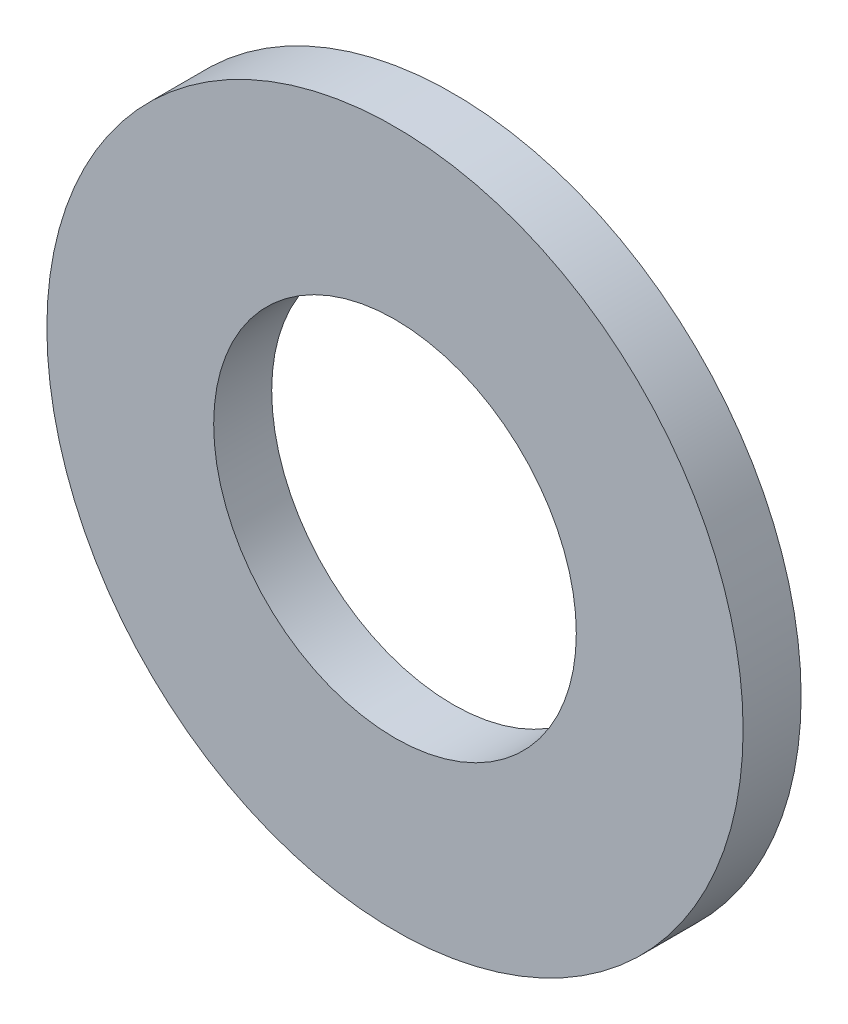
ISO-10303-21;
HEADER;
FILE_DESCRIPTION(('STEP AP214'),'2;1');
FILE_NAME('part.step','',(''),(''),'','','');
FILE_SCHEMA(('AUTOMOTIVE_DESIGN { 1 0 10303 214 1 1 1 1 }'));
ENDSEC;
DATA;
#1=APPLICATION_CONTEXT('core data for automotive mechanical design processes');
#2=APPLICATION_PROTOCOL_DEFINITION('international standard','automotive_design',2000,#1);
#3=PRODUCT_CONTEXT('',#1,'mechanical');
#4=PRODUCT('Part','Part','',(#3));
#5=PRODUCT_RELATED_PRODUCT_CATEGORY('part','',(#4));
#6=PRODUCT_DEFINITION_FORMATION('','',#4);
#7=PRODUCT_DEFINITION_CONTEXT('part definition',#1,'design');
#8=PRODUCT_DEFINITION('design','',#6,#7);
#9=PRODUCT_DEFINITION_SHAPE('','',#8);
#10=(LENGTH_UNIT() NAMED_UNIT(*) SI_UNIT(.MILLI.,.METRE.));
#11=(NAMED_UNIT(*) PLANE_ANGLE_UNIT() SI_UNIT($,.RADIAN.));
#12=(NAMED_UNIT(*) SI_UNIT($,.STERADIAN.) SOLID_ANGLE_UNIT());
#13=UNCERTAINTY_MEASURE_WITH_UNIT(LENGTH_MEASURE(1.E-05),#10,'distance_accuracy_value','');
#14=(GEOMETRIC_REPRESENTATION_CONTEXT(3) GLOBAL_UNCERTAINTY_ASSIGNED_CONTEXT((#13)) GLOBAL_UNIT_ASSIGNED_CONTEXT((#10,
#11,#12)) REPRESENTATION_CONTEXT('',''));
#15=CARTESIAN_POINT('',(0.,0.,0.));
#16=DIRECTION('',(0.,0.,1.));
#17=DIRECTION('',(1.,0.,0.));
#18=AXIS2_PLACEMENT_3D('',#15,#16,#17);
#19=CARTESIAN_POINT('',(0.,0.,1.));
#20=DIRECTION('',(0.,0.,1.));
#21=DIRECTION('',(1.,0.,0.));
#22=AXIS2_PLACEMENT_3D('',#19,#20,#21);
#23=PLANE('',#22);
#24=CARTESIAN_POINT('',(0.,0.,1.));
#25=DIRECTION('',(0.,0.,1.));
#26=DIRECTION('',(1.,0.,0.));
#27=AXIS2_PLACEMENT_3D('',#24,#25,#26);
#28=CIRCLE('',#27,6.);
#29=CARTESIAN_POINT('',(6.,0.,1.));
#30=VERTEX_POINT('',#29);
#31=EDGE_CURVE('E10',#30,#30,#28,.T.);
#32=ORIENTED_EDGE('',*,*,#31,.T.);
#33=EDGE_LOOP('',(#32));
#34=FACE_BOUND('',#33,.T.);
#35=CARTESIAN_POINT('',(0.,0.,1.));
#36=DIRECTION('',(0.,0.,1.));
#37=DIRECTION('',(1.,0.,0.));
#38=AXIS2_PLACEMENT_3D('',#35,#36,#37);
#39=CIRCLE('',#38,3.125);
#40=CARTESIAN_POINT('',(3.125,0.,1.));
#41=VERTEX_POINT('',#40);
#42=EDGE_CURVE('E54',#41,#41,#39,.T.);
#43=ORIENTED_EDGE('',*,*,#42,.F.);
#44=EDGE_LOOP('',(#43));
#45=FACE_BOUND('',#44,.T.);
#46=ADVANCED_FACE('F41',(#34,#45),#23,.T.);
#47=CARTESIAN_POINT('',(0.,0.,0.));
#48=DIRECTION('',(0.,0.,1.));
#49=DIRECTION('',(1.,0.,0.));
#50=AXIS2_PLACEMENT_3D('',#47,#48,#49);
#51=PLANE('',#50);
#52=CARTESIAN_POINT('',(0.,0.,0.));
#53=DIRECTION('',(0.,0.,1.));
#54=DIRECTION('',(1.,0.,0.));
#55=AXIS2_PLACEMENT_3D('',#52,#53,#54);
#56=CIRCLE('',#55,6.);
#57=CARTESIAN_POINT('',(6.,0.,0.));
#58=VERTEX_POINT('',#57);
#59=EDGE_CURVE('E45',#58,#58,#56,.T.);
#60=ORIENTED_EDGE('',*,*,#59,.F.);
#61=EDGE_LOOP('',(#60));
#62=FACE_BOUND('',#61,.T.);
#63=CARTESIAN_POINT('',(0.,0.,0.));
#64=DIRECTION('',(0.,0.,1.));
#65=DIRECTION('',(1.,0.,0.));
#66=AXIS2_PLACEMENT_3D('',#63,#64,#65);
#67=CIRCLE('',#66,3.125);
#68=CARTESIAN_POINT('',(3.125,0.,0.));
#69=VERTEX_POINT('',#68);
#70=EDGE_CURVE('E56',#69,#69,#67,.T.);
#71=ORIENTED_EDGE('',*,*,#70,.T.);
#72=EDGE_LOOP('',(#71));
#73=FACE_BOUND('',#72,.T.);
#74=ADVANCED_FACE('F68',(#62,#73),#51,.F.);
#75=CARTESIAN_POINT('',(0.,0.,1.));
#76=DIRECTION('',(0.,0.,-1.));
#77=DIRECTION('',(-1.,0.,0.));
#78=AXIS2_PLACEMENT_3D('',#75,#76,#77);
#79=CYLINDRICAL_SURFACE('',#78,6.);
#80=ORIENTED_EDGE('',*,*,#31,.F.);
#81=EDGE_LOOP('',(#80));
#82=FACE_BOUND('',#81,.T.);
#83=ORIENTED_EDGE('',*,*,#59,.T.);
#84=EDGE_LOOP('',(#83));
#85=FACE_BOUND('',#84,.T.);
#86=ADVANCED_FACE('F43',(#82,#85),#79,.T.);
#87=CARTESIAN_POINT('',(0.,0.,1.));
#88=DIRECTION('',(0.,0.,-1.));
#89=DIRECTION('',(-1.,0.,0.));
#90=AXIS2_PLACEMENT_3D('',#87,#88,#89);
#91=CYLINDRICAL_SURFACE('',#90,3.125);
#92=ORIENTED_EDGE('',*,*,#42,.T.);
#93=EDGE_LOOP('',(#92));
#94=FACE_BOUND('',#93,.T.);
#95=ORIENTED_EDGE('',*,*,#70,.F.);
#96=EDGE_LOOP('',(#95));
#97=FACE_BOUND('',#96,.T.);
#98=ADVANCED_FACE('F64',(#94,#97),#91,.F.);
#99=CLOSED_SHELL('',(#46,#74,#86,#98));
#100=MANIFOLD_SOLID_BREP('B2',#99);
#101=ADVANCED_BREP_SHAPE_REPRESENTATION('',(#18,#100),#14);
#102=SHAPE_DEFINITION_REPRESENTATION(#9,#101);
ENDSEC;
END-ISO-10303-21;
